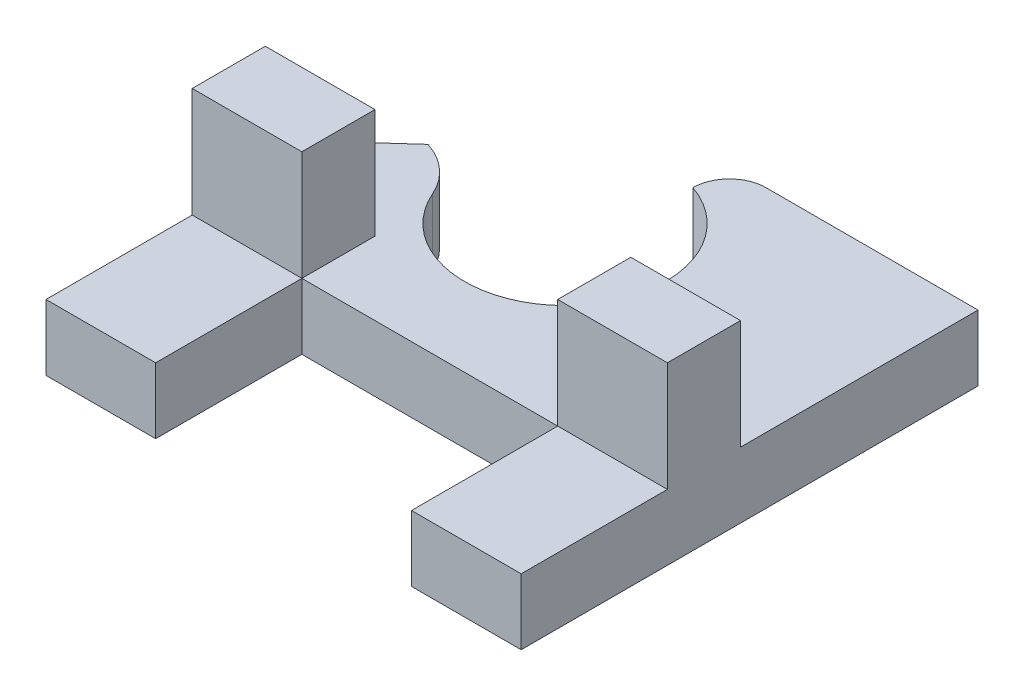
ISO-10303-21;
HEADER;
FILE_DESCRIPTION(('STEP AP214'),'2;1');
FILE_NAME('part.step','',(''),(''),'','','');
FILE_SCHEMA(('AUTOMOTIVE_DESIGN { 1 0 10303 214 1 1 1 1 }'));
ENDSEC;
DATA;
#1=APPLICATION_CONTEXT('core data for automotive mechanical design processes');
#2=APPLICATION_PROTOCOL_DEFINITION('international standard','automotive_design',2000,#1);
#3=PRODUCT_CONTEXT('',#1,'mechanical');
#4=PRODUCT('Part','Part','',(#3));
#5=PRODUCT_RELATED_PRODUCT_CATEGORY('part','',(#4));
#6=PRODUCT_DEFINITION_FORMATION('','',#4);
#7=PRODUCT_DEFINITION_CONTEXT('part definition',#1,'design');
#8=PRODUCT_DEFINITION('design','',#6,#7);
#9=PRODUCT_DEFINITION_SHAPE('','',#8);
#10=(LENGTH_UNIT() NAMED_UNIT(*) SI_UNIT(.MILLI.,.METRE.));
#11=(NAMED_UNIT(*) PLANE_ANGLE_UNIT() SI_UNIT($,.RADIAN.));
#12=(NAMED_UNIT(*) SI_UNIT($,.STERADIAN.) SOLID_ANGLE_UNIT());
#13=UNCERTAINTY_MEASURE_WITH_UNIT(LENGTH_MEASURE(1.E-05),#10,'distance_accuracy_value','');
#14=(GEOMETRIC_REPRESENTATION_CONTEXT(3) GLOBAL_UNCERTAINTY_ASSIGNED_CONTEXT((#13)) GLOBAL_UNIT_ASSIGNED_CONTEXT((#10,
#11,#12)) REPRESENTATION_CONTEXT('',''));
#15=CARTESIAN_POINT('',(0.,0.,0.));
#16=DIRECTION('',(0.,0.,1.));
#17=DIRECTION('',(1.,0.,0.));
#18=AXIS2_PLACEMENT_3D('',#15,#16,#17);
#19=CARTESIAN_POINT('',(-1.2,0.,-4.9));
#20=DIRECTION('',(0.,-1.,0.));
#21=DIRECTION('',(0.,0.,1.));
#22=AXIS2_PLACEMENT_3D('',#19,#20,#21);
#23=PLANE('',#22);
#24=DIRECTION('',(-1.,0.,0.));
#25=VECTOR('',#24,1.);
#26=CARTESIAN_POINT('',(-3.5,0.,0.));
#27=LINE('',#26,#25);
#28=CARTESIAN_POINT('',(-3.5,0.,0.));
#29=VERTEX_POINT('',#28);
#30=CARTESIAN_POINT('',(-6.5,0.,0.));
#31=VERTEX_POINT('',#30);
#32=EDGE_CURVE('E178',#29,#31,#27,.T.);
#33=ORIENTED_EDGE('',*,*,#32,.T.);
#34=DIRECTION('',(0.,0.,1.));
#35=VECTOR('',#34,1.);
#36=CARTESIAN_POINT('',(-6.5,0.,0.));
#37=LINE('',#36,#35);
#38=CARTESIAN_POINT('',(-6.5,0.,4.));
#39=VERTEX_POINT('',#38);
#40=EDGE_CURVE('E264',#31,#39,#37,.T.);
#41=ORIENTED_EDGE('',*,*,#40,.T.);
#42=DIRECTION('',(1.,0.,0.));
#43=VECTOR('',#42,1.);
#44=CARTESIAN_POINT('',(-6.5,0.,4.));
#45=LINE('',#44,#43);
#46=CARTESIAN_POINT('',(-3.5,0.,4.));
#47=VERTEX_POINT('',#46);
#48=EDGE_CURVE('E268',#39,#47,#45,.T.);
#49=ORIENTED_EDGE('',*,*,#48,.T.);
#50=DIRECTION('',(0.,0.,-1.));
#51=VECTOR('',#50,1.);
#52=CARTESIAN_POINT('',(-3.5,0.,0.));
#53=LINE('',#52,#51);
#54=EDGE_CURVE('E271',#47,#29,#53,.T.);
#55=ORIENTED_EDGE('',*,*,#54,.T.);
#56=EDGE_LOOP('',(#33,#41,#49,#55));
#57=FACE_BOUND('',#56,.T.);
#58=ADVANCED_FACE('F33',(#57),#23,.F.);
#59=DIRECTION('',(0.,0.,1.));
#60=VECTOR('',#59,1.);
#61=CARTESIAN_POINT('',(-3.5,0.,0.));
#62=LINE('',#61,#60);
#63=CARTESIAN_POINT('',(-3.5,0.,-2.));
#64=VERTEX_POINT('',#63);
#65=EDGE_CURVE('E194',#64,#29,#62,.T.);
#66=ORIENTED_EDGE('',*,*,#65,.T.);
#67=DIRECTION('',(1.,0.,0.));
#68=VECTOR('',#67,1.);
#69=CARTESIAN_POINT('',(3.5,0.,0.));
#70=LINE('',#69,#68);
#71=CARTESIAN_POINT('',(3.5,0.,0.));
#72=VERTEX_POINT('',#71);
#73=EDGE_CURVE('E274',#29,#72,#70,.T.);
#74=ORIENTED_EDGE('',*,*,#73,.T.);
#75=DIRECTION('',(0.,0.,-1.));
#76=VECTOR('',#75,1.);
#77=CARTESIAN_POINT('',(3.5,0.,0.));
#78=LINE('',#77,#76);
#79=CARTESIAN_POINT('',(3.5,0.,-2.));
#80=VERTEX_POINT('',#79);
#81=EDGE_CURVE('E182',#72,#80,#78,.T.);
#82=ORIENTED_EDGE('',*,*,#81,.T.);
#83=DIRECTION('',(1.,0.,0.));
#84=VECTOR('',#83,1.);
#85=CARTESIAN_POINT('',(3.5,0.,-2.));
#86=LINE('',#85,#84);
#87=CARTESIAN_POINT('',(6.5,0.,-2.));
#88=VERTEX_POINT('',#87);
#89=EDGE_CURVE('E215',#80,#88,#86,.T.);
#90=ORIENTED_EDGE('',*,*,#89,.T.);
#91=DIRECTION('',(0.,0.,-1.));
#92=VECTOR('',#91,1.);
#93=CARTESIAN_POINT('',(6.5,0.,-8.49855729203726));
#94=LINE('',#93,#92);
#95=CARTESIAN_POINT('',(6.5,0.,-8.49855729203726));
#96=VERTEX_POINT('',#95);
#97=EDGE_CURVE('E283',#88,#96,#94,.T.);
#98=ORIENTED_EDGE('',*,*,#97,.T.);
#99=DIRECTION('',(-1.,0.,0.));
#100=VECTOR('',#99,1.);
#101=CARTESIAN_POINT('',(-0.3,0.,-8.49855729203726));
#102=LINE('',#101,#100);
#103=CARTESIAN_POINT('',(0.7,0.,-8.49855729203726));
#104=VERTEX_POINT('',#103);
#105=EDGE_CURVE('E231',#96,#104,#102,.T.);
#106=ORIENTED_EDGE('',*,*,#105,.T.);
#107=CARTESIAN_POINT('',(0.7,0.,-7.49855729203726));
#108=DIRECTION('',(0.,1.,0.));
#109=DIRECTION('',(0.,0.,1.));
#110=AXIS2_PLACEMENT_3D('',#107,#108,#109);
#111=CIRCLE('',#110,1.);
#112=CARTESIAN_POINT('',(-0.3,0.,-7.49855729203726));
#113=VERTEX_POINT('',#112);
#114=EDGE_CURVE('E317',#113,#104,#111,.F.);
#115=ORIENTED_EDGE('',*,*,#114,.F.);
#116=CARTESIAN_POINT('',(-1.2,0.,-4.9));
#117=DIRECTION('',(0.,-1.,0.));
#118=DIRECTION('',(0.,0.,1.));
#119=AXIS2_PLACEMENT_3D('',#116,#117,#118);
#120=CIRCLE('',#119,2.75);
#121=CARTESIAN_POINT('',(-3.71842105263158,0.,-3.79543881941196));
#122=VERTEX_POINT('',#121);
#123=EDGE_CURVE('E226',#113,#122,#120,.T.);
#124=ORIENTED_EDGE('',*,*,#123,.T.);
#125=CARTESIAN_POINT('',(-5.55,0.,-2.99212159716611));
#126=DIRECTION('',(0.,1.,0.));
#127=DIRECTION('',(0.,0.,1.));
#128=AXIS2_PLACEMENT_3D('',#125,#126,#127);
#129=CIRCLE('',#128,2.);
#130=CARTESIAN_POINT('',(-4.95,0.,-4.9));
#131=VERTEX_POINT('',#130);
#132=EDGE_CURVE('E309',#131,#122,#129,.F.);
#133=ORIENTED_EDGE('',*,*,#132,.F.);
#134=DIRECTION('',(-0.742102642751139,0.,0.67028625796877));
#135=VECTOR('',#134,1.);
#136=CARTESIAN_POINT('',(-4.95,0.,-4.9));
#137=LINE('',#136,#135);
#138=CARTESIAN_POINT('',(-6.5,0.,-3.5));
#139=VERTEX_POINT('',#138);
#140=EDGE_CURVE('E261',#131,#139,#137,.T.);
#141=ORIENTED_EDGE('',*,*,#140,.T.);
#142=CARTESIAN_POINT('',(-6.5,0.,-2.));
#143=VERTEX_POINT('',#142);
#144=EDGE_CURVE('E265',#139,#143,#37,.T.);
#145=ORIENTED_EDGE('',*,*,#144,.T.);
#146=DIRECTION('',(1.,0.,0.));
#147=VECTOR('',#146,1.);
#148=CARTESIAN_POINT('',(-3.5,0.,-2.));
#149=LINE('',#148,#147);
#150=EDGE_CURVE('E186',#143,#64,#149,.T.);
#151=ORIENTED_EDGE('',*,*,#150,.T.);
#152=EDGE_LOOP('',(#66,#74,#82,#90,#98,#106,#115,#124,#133,#141,#145,#151));
#153=FACE_BOUND('',#152,.T.);
#154=ADVANCED_FACE('F337',(#153),#23,.F.);
#155=DIRECTION('',(-1.,0.,0.));
#156=VECTOR('',#155,1.);
#157=CARTESIAN_POINT('',(3.5,0.,0.));
#158=LINE('',#157,#156);
#159=CARTESIAN_POINT('',(6.5,0.,0.));
#160=VERTEX_POINT('',#159);
#161=EDGE_CURVE('E205',#160,#72,#158,.T.);
#162=ORIENTED_EDGE('',*,*,#161,.T.);
#163=DIRECTION('',(0.,0.,1.));
#164=VECTOR('',#163,1.);
#165=CARTESIAN_POINT('',(3.5,0.,0.));
#166=LINE('',#165,#164);
#167=CARTESIAN_POINT('',(3.5,0.,4.));
#168=VERTEX_POINT('',#167);
#169=EDGE_CURVE('E277',#72,#168,#166,.T.);
#170=ORIENTED_EDGE('',*,*,#169,.T.);
#171=DIRECTION('',(1.,0.,0.));
#172=VECTOR('',#171,1.);
#173=CARTESIAN_POINT('',(6.5,0.,4.));
#174=LINE('',#173,#172);
#175=CARTESIAN_POINT('',(6.5,0.,4.));
#176=VERTEX_POINT('',#175);
#177=EDGE_CURVE('E280',#168,#176,#174,.T.);
#178=ORIENTED_EDGE('',*,*,#177,.T.);
#179=EDGE_CURVE('E284',#176,#160,#94,.T.);
#180=ORIENTED_EDGE('',*,*,#179,.T.);
#181=EDGE_LOOP('',(#162,#170,#178,#180));
#182=FACE_BOUND('',#181,.T.);
#183=ADVANCED_FACE('F382',(#182),#23,.F.);
#184=CARTESIAN_POINT('',(-1.2,-1.8,-4.9));
#185=DIRECTION('',(0.,1.,0.));
#186=DIRECTION('',(0.,0.,-1.));
#187=AXIS2_PLACEMENT_3D('',#184,#185,#186);
#188=CYLINDRICAL_SURFACE('',#187,2.75);
#189=ORIENTED_EDGE('',*,*,#123,.F.);
#190=DIRECTION('',(0.,1.,0.));
#191=VECTOR('',#190,1.);
#192=CARTESIAN_POINT('',(-0.3,-1.8,-7.49855729203726));
#193=LINE('',#192,#191);
#194=CARTESIAN_POINT('',(-0.3,-1.8,-7.49855729203726));
#195=VERTEX_POINT('',#194);
#196=EDGE_CURVE('E258',#195,#113,#193,.T.);
#197=ORIENTED_EDGE('',*,*,#196,.F.);
#198=CARTESIAN_POINT('',(-1.2,-1.8,-4.9));
#199=DIRECTION('',(0.,-1.,0.));
#200=DIRECTION('',(0.,0.,1.));
#201=AXIS2_PLACEMENT_3D('',#198,#199,#200);
#202=CIRCLE('',#201,2.75);
#203=CARTESIAN_POINT('',(-3.71842105263158,-1.8,-3.79543881941196));
#204=VERTEX_POINT('',#203);
#205=EDGE_CURVE('E227',#195,#204,#202,.T.);
#206=ORIENTED_EDGE('',*,*,#205,.T.);
#207=DIRECTION('',(0.,1.,0.));
#208=VECTOR('',#207,1.);
#209=CARTESIAN_POINT('',(-3.71842105263158,-1.8,-3.79543881941196));
#210=LINE('',#209,#208);
#211=EDGE_CURVE('E312',#122,#204,#210,.F.);
#212=ORIENTED_EDGE('',*,*,#211,.F.);
#213=EDGE_LOOP('',(#189,#197,#206,#212));
#214=FACE_BOUND('',#213,.T.);
#215=ADVANCED_FACE('F334',(#214),#188,.F.);
#216=CARTESIAN_POINT('',(-4.95,-1.8,-4.9));
#217=DIRECTION('',(0.67028625796877,0.,0.742102642751139));
#218=DIRECTION('',(0.742102642751139,0.,-0.67028625796877));
#219=AXIS2_PLACEMENT_3D('',#216,#217,#218);
#220=PLANE('',#219);
#221=ORIENTED_EDGE('',*,*,#140,.F.);
#222=DIRECTION('',(0.,1.,0.));
#223=VECTOR('',#222,1.);
#224=CARTESIAN_POINT('',(-4.95,-1.8,-4.9));
#225=LINE('',#224,#223);
#226=CARTESIAN_POINT('',(-4.95,-1.8,-4.9));
#227=VERTEX_POINT('',#226);
#228=EDGE_CURVE('E307',#227,#131,#225,.T.);
#229=ORIENTED_EDGE('',*,*,#228,.F.);
#230=DIRECTION('',(-0.742102642751139,0.,0.67028625796877));
#231=VECTOR('',#230,1.);
#232=CARTESIAN_POINT('',(-4.95,-1.8,-4.9));
#233=LINE('',#232,#231);
#234=CARTESIAN_POINT('',(-6.5,-1.8,-3.5));
#235=VERTEX_POINT('',#234);
#236=EDGE_CURVE('E230',#227,#235,#233,.T.);
#237=ORIENTED_EDGE('',*,*,#236,.T.);
#238=DIRECTION('',(0.,1.,0.));
#239=VECTOR('',#238,1.);
#240=CARTESIAN_POINT('',(-6.5,-1.8,-3.5));
#241=LINE('',#240,#239);
#242=EDGE_CURVE('E305',#235,#139,#241,.T.);
#243=ORIENTED_EDGE('',*,*,#242,.T.);
#244=EDGE_LOOP('',(#221,#229,#237,#243));
#245=FACE_BOUND('',#244,.T.);
#246=ADVANCED_FACE('F372',(#245),#220,.F.);
#247=CARTESIAN_POINT('',(-6.5,-1.8,0.));
#248=DIRECTION('',(1.,0.,0.));
#249=DIRECTION('',(0.,0.,-1.));
#250=AXIS2_PLACEMENT_3D('',#247,#248,#249);
#251=PLANE('',#250);
#252=ORIENTED_EDGE('',*,*,#144,.F.);
#253=ORIENTED_EDGE('',*,*,#242,.F.);
#254=DIRECTION('',(0.,0.,1.));
#255=VECTOR('',#254,1.);
#256=CARTESIAN_POINT('',(-6.5,-1.8,-2.5));
#257=LINE('',#256,#255);
#258=CARTESIAN_POINT('',(-6.5,-1.8,4.));
#259=VERTEX_POINT('',#258);
#260=EDGE_CURVE('E234',#235,#259,#257,.T.);
#261=ORIENTED_EDGE('',*,*,#260,.T.);
#262=DIRECTION('',(0.,1.,0.));
#263=VECTOR('',#262,1.);
#264=CARTESIAN_POINT('',(-6.5,-1.8,4.));
#265=LINE('',#264,#263);
#266=EDGE_CURVE('E303',#259,#39,#265,.T.);
#267=ORIENTED_EDGE('',*,*,#266,.T.);
#268=ORIENTED_EDGE('',*,*,#40,.F.);
#269=DIRECTION('',(0.,-1.,0.));
#270=VECTOR('',#269,1.);
#271=CARTESIAN_POINT('',(-6.5,3.,0.));
#272=LINE('',#271,#270);
#273=CARTESIAN_POINT('',(-6.5,3.,0.));
#274=VERTEX_POINT('',#273);
#275=EDGE_CURVE('E48',#274,#31,#272,.T.);
#276=ORIENTED_EDGE('',*,*,#275,.F.);
#277=DIRECTION('',(0.,0.,-1.));
#278=VECTOR('',#277,1.);
#279=CARTESIAN_POINT('',(-6.5,3.,0.));
#280=LINE('',#279,#278);
#281=CARTESIAN_POINT('',(-6.5,3.,-2.));
#282=VERTEX_POINT('',#281);
#283=EDGE_CURVE('E173',#274,#282,#280,.T.);
#284=ORIENTED_EDGE('',*,*,#283,.T.);
#285=DIRECTION('',(0.,-1.,0.));
#286=VECTOR('',#285,1.);
#287=CARTESIAN_POINT('',(-6.5,3.,-2.));
#288=LINE('',#287,#286);
#289=EDGE_CURVE('E199',#282,#143,#288,.T.);
#290=ORIENTED_EDGE('',*,*,#289,.T.);
#291=EDGE_LOOP('',(#252,#253,#261,#267,#268,#276,#284,#290));
#292=FACE_BOUND('',#291,.T.);
#293=ADVANCED_FACE('F368',(#292),#251,.F.);
#294=CARTESIAN_POINT('',(-6.5,-1.8,4.));
#295=DIRECTION('',(0.,0.,-1.));
#296=DIRECTION('',(-1.,0.,0.));
#297=AXIS2_PLACEMENT_3D('',#294,#295,#296);
#298=PLANE('',#297);
#299=ORIENTED_EDGE('',*,*,#48,.F.);
#300=ORIENTED_EDGE('',*,*,#266,.F.);
#301=DIRECTION('',(1.,0.,0.));
#302=VECTOR('',#301,1.);
#303=CARTESIAN_POINT('',(-6.5,-1.8,4.));
#304=LINE('',#303,#302);
#305=CARTESIAN_POINT('',(-3.5,-1.8,4.));
#306=VERTEX_POINT('',#305);
#307=EDGE_CURVE('E237',#259,#306,#304,.T.);
#308=ORIENTED_EDGE('',*,*,#307,.T.);
#309=DIRECTION('',(0.,1.,0.));
#310=VECTOR('',#309,1.);
#311=CARTESIAN_POINT('',(-3.5,-1.8,4.));
#312=LINE('',#311,#310);
#313=EDGE_CURVE('E301',#306,#47,#312,.T.);
#314=ORIENTED_EDGE('',*,*,#313,.T.);
#315=EDGE_LOOP('',(#299,#300,#308,#314));
#316=FACE_BOUND('',#315,.T.);
#317=ADVANCED_FACE('F364',(#316),#298,.F.);
#318=CARTESIAN_POINT('',(-3.5,-1.8,0.));
#319=DIRECTION('',(-1.,0.,0.));
#320=DIRECTION('',(0.,0.,1.));
#321=AXIS2_PLACEMENT_3D('',#318,#319,#320);
#322=PLANE('',#321);
#323=ORIENTED_EDGE('',*,*,#54,.F.);
#324=ORIENTED_EDGE('',*,*,#313,.F.);
#325=DIRECTION('',(0.,0.,-1.));
#326=VECTOR('',#325,1.);
#327=CARTESIAN_POINT('',(-3.5,-1.8,0.));
#328=LINE('',#327,#326);
#329=CARTESIAN_POINT('',(-3.5,-1.8,0.));
#330=VERTEX_POINT('',#329);
#331=EDGE_CURVE('E240',#306,#330,#328,.T.);
#332=ORIENTED_EDGE('',*,*,#331,.T.);
#333=DIRECTION('',(0.,1.,0.));
#334=VECTOR('',#333,1.);
#335=CARTESIAN_POINT('',(-3.5,-1.8,0.));
#336=LINE('',#335,#334);
#337=EDGE_CURVE('E299',#330,#29,#336,.T.);
#338=ORIENTED_EDGE('',*,*,#337,.T.);
#339=EDGE_LOOP('',(#323,#324,#332,#338));
#340=FACE_BOUND('',#339,.T.);
#341=ADVANCED_FACE('F359',(#340),#322,.F.);
#342=CARTESIAN_POINT('',(3.5,-1.8,0.));
#343=DIRECTION('',(0.,0.,-1.));
#344=DIRECTION('',(-1.,0.,0.));
#345=AXIS2_PLACEMENT_3D('',#342,#343,#344);
#346=PLANE('',#345);
#347=ORIENTED_EDGE('',*,*,#73,.F.);
#348=ORIENTED_EDGE('',*,*,#337,.F.);
#349=DIRECTION('',(1.,0.,0.));
#350=VECTOR('',#349,1.);
#351=CARTESIAN_POINT('',(3.5,-1.8,0.));
#352=LINE('',#351,#350);
#353=CARTESIAN_POINT('',(3.5,-1.8,0.));
#354=VERTEX_POINT('',#353);
#355=EDGE_CURVE('E243',#330,#354,#352,.T.);
#356=ORIENTED_EDGE('',*,*,#355,.T.);
#357=DIRECTION('',(0.,1.,0.));
#358=VECTOR('',#357,1.);
#359=CARTESIAN_POINT('',(3.5,-1.8,0.));
#360=LINE('',#359,#358);
#361=EDGE_CURVE('E296',#354,#72,#360,.T.);
#362=ORIENTED_EDGE('',*,*,#361,.T.);
#363=EDGE_LOOP('',(#347,#348,#356,#362));
#364=FACE_BOUND('',#363,.T.);
#365=ADVANCED_FACE('F355',(#364),#346,.F.);
#366=CARTESIAN_POINT('',(3.5,-1.8,0.));
#367=DIRECTION('',(1.,0.,0.));
#368=DIRECTION('',(0.,0.,-1.));
#369=AXIS2_PLACEMENT_3D('',#366,#367,#368);
#370=PLANE('',#369);
#371=ORIENTED_EDGE('',*,*,#169,.F.);
#372=ORIENTED_EDGE('',*,*,#361,.F.);
#373=DIRECTION('',(0.,0.,1.));
#374=VECTOR('',#373,1.);
#375=CARTESIAN_POINT('',(3.5,-1.8,0.));
#376=LINE('',#375,#374);
#377=CARTESIAN_POINT('',(3.5,-1.8,4.));
#378=VERTEX_POINT('',#377);
#379=EDGE_CURVE('E246',#354,#378,#376,.T.);
#380=ORIENTED_EDGE('',*,*,#379,.T.);
#381=DIRECTION('',(0.,1.,0.));
#382=VECTOR('',#381,1.);
#383=CARTESIAN_POINT('',(3.5,-1.8,4.));
#384=LINE('',#383,#382);
#385=EDGE_CURVE('E294',#378,#168,#384,.T.);
#386=ORIENTED_EDGE('',*,*,#385,.T.);
#387=EDGE_LOOP('',(#371,#372,#380,#386));
#388=FACE_BOUND('',#387,.T.);
#389=ADVANCED_FACE('F352',(#388),#370,.F.);
#390=CARTESIAN_POINT('',(6.5,-1.8,4.));
#391=DIRECTION('',(0.,0.,-1.));
#392=DIRECTION('',(-1.,0.,0.));
#393=AXIS2_PLACEMENT_3D('',#390,#391,#392);
#394=PLANE('',#393);
#395=ORIENTED_EDGE('',*,*,#177,.F.);
#396=ORIENTED_EDGE('',*,*,#385,.F.);
#397=DIRECTION('',(1.,0.,0.));
#398=VECTOR('',#397,1.);
#399=CARTESIAN_POINT('',(6.5,-1.8,4.));
#400=LINE('',#399,#398);
#401=CARTESIAN_POINT('',(6.5,-1.8,4.));
#402=VERTEX_POINT('',#401);
#403=EDGE_CURVE('E249',#378,#402,#400,.T.);
#404=ORIENTED_EDGE('',*,*,#403,.T.);
#405=DIRECTION('',(0.,1.,0.));
#406=VECTOR('',#405,1.);
#407=CARTESIAN_POINT('',(6.5,-1.8,4.));
#408=LINE('',#407,#406);
#409=EDGE_CURVE('E292',#402,#176,#408,.T.);
#410=ORIENTED_EDGE('',*,*,#409,.T.);
#411=EDGE_LOOP('',(#395,#396,#404,#410));
#412=FACE_BOUND('',#411,.T.);
#413=ADVANCED_FACE('F347',(#412),#394,.F.);
#414=CARTESIAN_POINT('',(6.5,-1.8,-8.49855729203726));
#415=DIRECTION('',(-1.,0.,0.));
#416=DIRECTION('',(0.,0.,1.));
#417=AXIS2_PLACEMENT_3D('',#414,#415,#416);
#418=PLANE('',#417);
#419=ORIENTED_EDGE('',*,*,#179,.F.);
#420=ORIENTED_EDGE('',*,*,#409,.F.);
#421=DIRECTION('',(0.,0.,-1.));
#422=VECTOR('',#421,1.);
#423=CARTESIAN_POINT('',(6.5,-1.8,0.));
#424=LINE('',#423,#422);
#425=CARTESIAN_POINT('',(6.5,-1.8,-8.49855729203726));
#426=VERTEX_POINT('',#425);
#427=EDGE_CURVE('E252',#402,#426,#424,.T.);
#428=ORIENTED_EDGE('',*,*,#427,.T.);
#429=DIRECTION('',(0.,1.,0.));
#430=VECTOR('',#429,1.);
#431=CARTESIAN_POINT('',(6.5,-1.8,-8.49855729203726));
#432=LINE('',#431,#430);
#433=EDGE_CURVE('E290',#426,#96,#432,.T.);
#434=ORIENTED_EDGE('',*,*,#433,.T.);
#435=ORIENTED_EDGE('',*,*,#97,.F.);
#436=DIRECTION('',(0.,-1.,0.));
#437=VECTOR('',#436,1.);
#438=CARTESIAN_POINT('',(6.5,3.,-2.));
#439=LINE('',#438,#437);
#440=CARTESIAN_POINT('',(6.5,3.,-2.));
#441=VERTEX_POINT('',#440);
#442=EDGE_CURVE('E223',#441,#88,#439,.T.);
#443=ORIENTED_EDGE('',*,*,#442,.F.);
#444=DIRECTION('',(0.,0.,1.));
#445=VECTOR('',#444,1.);
#446=CARTESIAN_POINT('',(6.5,3.,0.));
#447=LINE('',#446,#445);
#448=CARTESIAN_POINT('',(6.5,3.,0.));
#449=VERTEX_POINT('',#448);
#450=EDGE_CURVE('E207',#441,#449,#447,.T.);
#451=ORIENTED_EDGE('',*,*,#450,.T.);
#452=DIRECTION('',(0.,-1.,0.));
#453=VECTOR('',#452,1.);
#454=CARTESIAN_POINT('',(6.5,3.,0.));
#455=LINE('',#454,#453);
#456=EDGE_CURVE('E221',#449,#160,#455,.T.);
#457=ORIENTED_EDGE('',*,*,#456,.T.);
#458=EDGE_LOOP('',(#419,#420,#428,#434,#435,#443,#451,#457));
#459=FACE_BOUND('',#458,.T.);
#460=ADVANCED_FACE('F343',(#459),#418,.F.);
#461=CARTESIAN_POINT('',(-0.3,-1.8,-8.49855729203726));
#462=DIRECTION('',(0.,0.,1.));
#463=DIRECTION('',(1.,0.,0.));
#464=AXIS2_PLACEMENT_3D('',#461,#462,#463);
#465=PLANE('',#464);
#466=ORIENTED_EDGE('',*,*,#105,.F.);
#467=ORIENTED_EDGE('',*,*,#433,.F.);
#468=DIRECTION('',(-1.,0.,0.));
#469=VECTOR('',#468,1.);
#470=CARTESIAN_POINT('',(-0.3,-1.8,-8.49855729203726));
#471=LINE('',#470,#469);
#472=CARTESIAN_POINT('',(0.7,-1.8,-8.49855729203726));
#473=VERTEX_POINT('',#472);
#474=EDGE_CURVE('E255',#426,#473,#471,.T.);
#475=ORIENTED_EDGE('',*,*,#474,.T.);
#476=DIRECTION('',(0.,1.,0.));
#477=VECTOR('',#476,1.);
#478=CARTESIAN_POINT('',(0.7,-1.8,-8.49855729203726));
#479=LINE('',#478,#477);
#480=EDGE_CURVE('E41',#104,#473,#479,.F.);
#481=ORIENTED_EDGE('',*,*,#480,.F.);
#482=EDGE_LOOP('',(#466,#467,#475,#481));
#483=FACE_BOUND('',#482,.T.);
#484=ADVANCED_FACE('F326',(#483),#465,.F.);
#485=CARTESIAN_POINT('',(-1.2,-1.8,-4.9));
#486=DIRECTION('',(0.,-1.,0.));
#487=DIRECTION('',(0.,0.,1.));
#488=AXIS2_PLACEMENT_3D('',#485,#486,#487);
#489=PLANE('',#488);
#490=ORIENTED_EDGE('',*,*,#474,.F.);
#491=ORIENTED_EDGE('',*,*,#427,.F.);
#492=ORIENTED_EDGE('',*,*,#403,.F.);
#493=ORIENTED_EDGE('',*,*,#379,.F.);
#494=ORIENTED_EDGE('',*,*,#355,.F.);
#495=ORIENTED_EDGE('',*,*,#331,.F.);
#496=ORIENTED_EDGE('',*,*,#307,.F.);
#497=ORIENTED_EDGE('',*,*,#260,.F.);
#498=ORIENTED_EDGE('',*,*,#236,.F.);
#499=CARTESIAN_POINT('',(-5.55,-1.8,-2.99212159716611));
#500=DIRECTION('',(0.,1.,0.));
#501=DIRECTION('',(0.,0.,1.));
#502=AXIS2_PLACEMENT_3D('',#499,#500,#501);
#503=CIRCLE('',#502,2.);
#504=EDGE_CURVE('E315',#204,#227,#503,.T.);
#505=ORIENTED_EDGE('',*,*,#504,.F.);
#506=ORIENTED_EDGE('',*,*,#205,.F.);
#507=CARTESIAN_POINT('',(0.7,-1.8,-7.49855729203726));
#508=DIRECTION('',(0.,1.,0.));
#509=DIRECTION('',(0.,0.,1.));
#510=AXIS2_PLACEMENT_3D('',#507,#508,#509);
#511=CIRCLE('',#510,1.);
#512=EDGE_CURVE('E11',#473,#195,#511,.T.);
#513=ORIENTED_EDGE('',*,*,#512,.F.);
#514=EDGE_LOOP('',(#490,#491,#492,#493,#494,#495,#496,#497,#498,#505,#506,#513));
#515=FACE_BOUND('',#514,.T.);
#516=ADVANCED_FACE('F328',(#515),#489,.T.);
#517=CARTESIAN_POINT('',(-5.55,-1.8,-2.99212159716611));
#518=DIRECTION('',(0.,1.,0.));
#519=DIRECTION('',(0.,0.,-1.));
#520=AXIS2_PLACEMENT_3D('',#517,#518,#519);
#521=CYLINDRICAL_SURFACE('',#520,2.);
#522=ORIENTED_EDGE('',*,*,#504,.T.);
#523=ORIENTED_EDGE('',*,*,#228,.T.);
#524=ORIENTED_EDGE('',*,*,#132,.T.);
#525=ORIENTED_EDGE('',*,*,#211,.T.);
#526=EDGE_LOOP('',(#522,#523,#524,#525));
#527=FACE_BOUND('',#526,.T.);
#528=ADVANCED_FACE('F374',(#527),#521,.T.);
#529=CARTESIAN_POINT('',(0.7,-1.8,-7.49855729203726));
#530=DIRECTION('',(0.,1.,0.));
#531=DIRECTION('',(0.,0.,-1.));
#532=AXIS2_PLACEMENT_3D('',#529,#530,#531);
#533=CYLINDRICAL_SURFACE('',#532,1.);
#534=ORIENTED_EDGE('',*,*,#512,.T.);
#535=ORIENTED_EDGE('',*,*,#196,.T.);
#536=ORIENTED_EDGE('',*,*,#114,.T.);
#537=ORIENTED_EDGE('',*,*,#480,.T.);
#538=EDGE_LOOP('',(#534,#535,#536,#537));
#539=FACE_BOUND('',#538,.T.);
#540=ADVANCED_FACE('F35',(#539),#533,.T.);
#541=CARTESIAN_POINT('',(3.5,3.,0.));
#542=DIRECTION('',(1.,0.,0.));
#543=DIRECTION('',(0.,0.,-1.));
#544=AXIS2_PLACEMENT_3D('',#541,#542,#543);
#545=PLANE('',#544);
#546=ORIENTED_EDGE('',*,*,#81,.F.);
#547=DIRECTION('',(0.,-1.,0.));
#548=VECTOR('',#547,1.);
#549=CARTESIAN_POINT('',(3.5,3.,0.));
#550=LINE('',#549,#548);
#551=CARTESIAN_POINT('',(3.5,3.,0.));
#552=VERTEX_POINT('',#551);
#553=EDGE_CURVE('E212',#552,#72,#550,.T.);
#554=ORIENTED_EDGE('',*,*,#553,.F.);
#555=DIRECTION('',(0.,0.,-1.));
#556=VECTOR('',#555,1.);
#557=CARTESIAN_POINT('',(3.5,3.,0.));
#558=LINE('',#557,#556);
#559=CARTESIAN_POINT('',(3.5,3.,-2.));
#560=VERTEX_POINT('',#559);
#561=EDGE_CURVE('E202',#552,#560,#558,.T.);
#562=ORIENTED_EDGE('',*,*,#561,.T.);
#563=DIRECTION('',(0.,-1.,0.));
#564=VECTOR('',#563,1.);
#565=CARTESIAN_POINT('',(3.5,3.,-2.));
#566=LINE('',#565,#564);
#567=EDGE_CURVE('E56',#560,#80,#566,.T.);
#568=ORIENTED_EDGE('',*,*,#567,.T.);
#569=EDGE_LOOP('',(#546,#554,#562,#568));
#570=FACE_BOUND('',#569,.T.);
#571=ADVANCED_FACE('F398',(#570),#545,.F.);
#572=CARTESIAN_POINT('',(3.5,3.,-2.));
#573=DIRECTION('',(0.,0.,1.));
#574=DIRECTION('',(1.,0.,0.));
#575=AXIS2_PLACEMENT_3D('',#572,#573,#574);
#576=PLANE('',#575);
#577=ORIENTED_EDGE('',*,*,#89,.F.);
#578=ORIENTED_EDGE('',*,*,#567,.F.);
#579=DIRECTION('',(1.,0.,0.));
#580=VECTOR('',#579,1.);
#581=CARTESIAN_POINT('',(3.5,3.,-2.));
#582=LINE('',#581,#580);
#583=EDGE_CURVE('E204',#560,#441,#582,.T.);
#584=ORIENTED_EDGE('',*,*,#583,.T.);
#585=ORIENTED_EDGE('',*,*,#442,.T.);
#586=EDGE_LOOP('',(#577,#578,#584,#585));
#587=FACE_BOUND('',#586,.T.);
#588=ADVANCED_FACE('F405',(#587),#576,.F.);
#589=CARTESIAN_POINT('',(3.5,3.,0.));
#590=DIRECTION('',(0.,0.,-1.));
#591=DIRECTION('',(-1.,0.,0.));
#592=AXIS2_PLACEMENT_3D('',#589,#590,#591);
#593=PLANE('',#592);
#594=ORIENTED_EDGE('',*,*,#161,.F.);
#595=ORIENTED_EDGE('',*,*,#456,.F.);
#596=DIRECTION('',(-1.,0.,0.));
#597=VECTOR('',#596,1.);
#598=CARTESIAN_POINT('',(3.5,3.,0.));
#599=LINE('',#598,#597);
#600=EDGE_CURVE('E210',#449,#552,#599,.T.);
#601=ORIENTED_EDGE('',*,*,#600,.T.);
#602=ORIENTED_EDGE('',*,*,#553,.T.);
#603=EDGE_LOOP('',(#594,#595,#601,#602));
#604=FACE_BOUND('',#603,.T.);
#605=ADVANCED_FACE('F400',(#604),#593,.F.);
#606=CARTESIAN_POINT('',(0.,3.,0.));
#607=DIRECTION('',(0.,1.,0.));
#608=DIRECTION('',(0.,0.,-1.));
#609=AXIS2_PLACEMENT_3D('',#606,#607,#608);
#610=PLANE('',#609);
#611=ORIENTED_EDGE('',*,*,#561,.F.);
#612=ORIENTED_EDGE('',*,*,#600,.F.);
#613=ORIENTED_EDGE('',*,*,#450,.F.);
#614=ORIENTED_EDGE('',*,*,#583,.F.);
#615=EDGE_LOOP('',(#611,#612,#613,#614));
#616=FACE_BOUND('',#615,.T.);
#617=ADVANCED_FACE('F403',(#616),#610,.T.);
#618=CARTESIAN_POINT('',(-3.5,3.,0.));
#619=DIRECTION('',(-1.,0.,0.));
#620=DIRECTION('',(0.,0.,1.));
#621=AXIS2_PLACEMENT_3D('',#618,#619,#620);
#622=PLANE('',#621);
#623=ORIENTED_EDGE('',*,*,#65,.F.);
#624=DIRECTION('',(0.,-1.,0.));
#625=VECTOR('',#624,1.);
#626=CARTESIAN_POINT('',(-3.5,3.,-2.));
#627=LINE('',#626,#625);
#628=CARTESIAN_POINT('',(-3.5,3.,-2.));
#629=VERTEX_POINT('',#628);
#630=EDGE_CURVE('E185',#629,#64,#627,.T.);
#631=ORIENTED_EDGE('',*,*,#630,.F.);
#632=DIRECTION('',(0.,0.,1.));
#633=VECTOR('',#632,1.);
#634=CARTESIAN_POINT('',(-3.5,3.,0.));
#635=LINE('',#634,#633);
#636=CARTESIAN_POINT('',(-3.5,3.,0.));
#637=VERTEX_POINT('',#636);
#638=EDGE_CURVE('E170',#629,#637,#635,.T.);
#639=ORIENTED_EDGE('',*,*,#638,.T.);
#640=DIRECTION('',(0.,-1.,0.));
#641=VECTOR('',#640,1.);
#642=CARTESIAN_POINT('',(-3.5,3.,0.));
#643=LINE('',#642,#641);
#644=EDGE_CURVE('E175',#637,#29,#643,.T.);
#645=ORIENTED_EDGE('',*,*,#644,.T.);
#646=EDGE_LOOP('',(#623,#631,#639,#645));
#647=FACE_BOUND('',#646,.T.);
#648=ADVANCED_FACE('F184',(#647),#622,.F.);
#649=CARTESIAN_POINT('',(-3.5,3.,0.));
#650=DIRECTION('',(0.,0.,-1.));
#651=DIRECTION('',(-1.,0.,0.));
#652=AXIS2_PLACEMENT_3D('',#649,#650,#651);
#653=PLANE('',#652);
#654=ORIENTED_EDGE('',*,*,#32,.F.);
#655=ORIENTED_EDGE('',*,*,#644,.F.);
#656=DIRECTION('',(-1.,0.,0.));
#657=VECTOR('',#656,1.);
#658=CARTESIAN_POINT('',(-3.5,3.,0.));
#659=LINE('',#658,#657);
#660=EDGE_CURVE('E166',#637,#274,#659,.T.);
#661=ORIENTED_EDGE('',*,*,#660,.T.);
#662=ORIENTED_EDGE('',*,*,#275,.T.);
#663=EDGE_LOOP('',(#654,#655,#661,#662));
#664=FACE_BOUND('',#663,.T.);
#665=ADVANCED_FACE('F176',(#664),#653,.F.);
#666=CARTESIAN_POINT('',(-3.5,3.,-2.));
#667=DIRECTION('',(0.,0.,1.));
#668=DIRECTION('',(1.,0.,0.));
#669=AXIS2_PLACEMENT_3D('',#666,#667,#668);
#670=PLANE('',#669);
#671=ORIENTED_EDGE('',*,*,#150,.F.);
#672=ORIENTED_EDGE('',*,*,#289,.F.);
#673=DIRECTION('',(1.,0.,0.));
#674=VECTOR('',#673,1.);
#675=CARTESIAN_POINT('',(-3.5,3.,-2.));
#676=LINE('',#675,#674);
#677=EDGE_CURVE('E192',#282,#629,#676,.T.);
#678=ORIENTED_EDGE('',*,*,#677,.T.);
#679=ORIENTED_EDGE('',*,*,#630,.T.);
#680=EDGE_LOOP('',(#671,#672,#678,#679));
#681=FACE_BOUND('',#680,.T.);
#682=ADVANCED_FACE('F378',(#681),#670,.F.);
#683=CARTESIAN_POINT('',(0.,3.,0.));
#684=DIRECTION('',(0.,-1.,0.));
#685=DIRECTION('',(0.,0.,1.));
#686=AXIS2_PLACEMENT_3D('',#683,#684,#685);
#687=PLANE('',#686);
#688=ORIENTED_EDGE('',*,*,#638,.F.);
#689=ORIENTED_EDGE('',*,*,#677,.F.);
#690=ORIENTED_EDGE('',*,*,#283,.F.);
#691=ORIENTED_EDGE('',*,*,#660,.F.);
#692=EDGE_LOOP('',(#688,#689,#690,#691));
#693=FACE_BOUND('',#692,.T.);
#694=ADVANCED_FACE('F168',(#693),#687,.F.);
#695=CLOSED_SHELL('',(#58,#154,#183,#215,#246,#293,#317,#341,#365,#389,#413,#460,#484,#516,#528,
#540,#571,#588,#605,#617,#648,#665,#682,#694));
#696=MANIFOLD_SOLID_BREP('B2',#695);
#697=ADVANCED_BREP_SHAPE_REPRESENTATION('',(#18,#696),#14);
#698=SHAPE_DEFINITION_REPRESENTATION(#9,#697);
ENDSEC;
END-ISO-10303-21;
